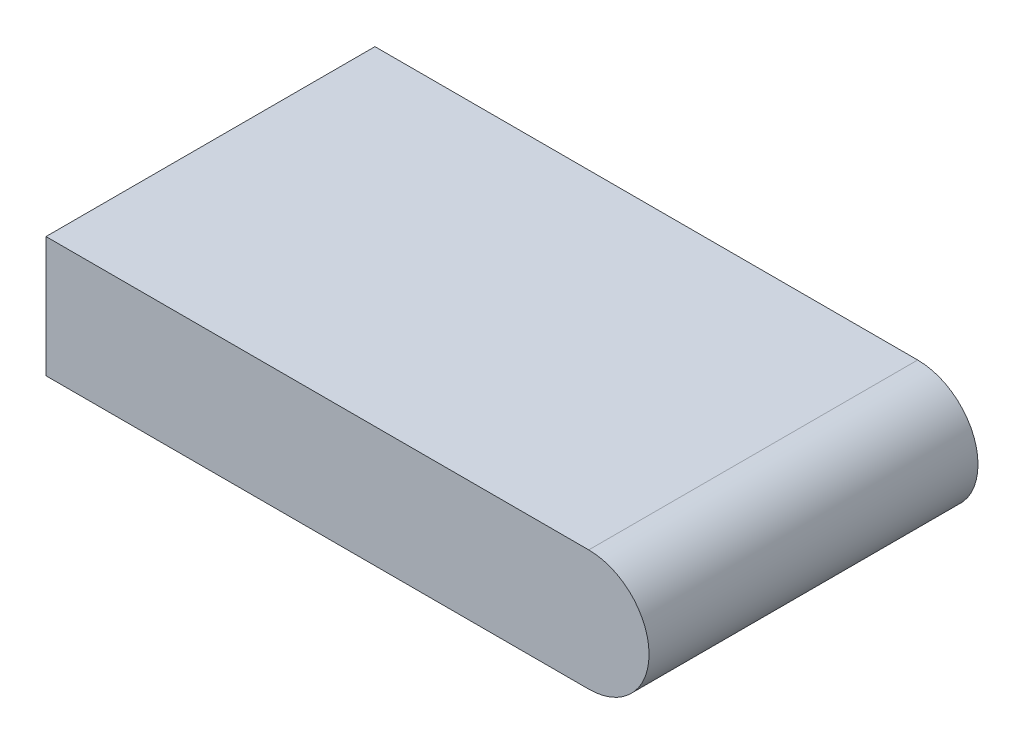
ISO-10303-21;
HEADER;
FILE_DESCRIPTION(('STEP AP214'),'2;1');
FILE_NAME('part.step','',(''),(''),'','','');
FILE_SCHEMA(('AUTOMOTIVE_DESIGN { 1 0 10303 214 1 1 1 1 }'));
ENDSEC;
DATA;
#1=APPLICATION_CONTEXT('core data for automotive mechanical design processes');
#2=APPLICATION_PROTOCOL_DEFINITION('international standard','automotive_design',2000,#1);
#3=PRODUCT_CONTEXT('',#1,'mechanical');
#4=PRODUCT('Part','Part','',(#3));
#5=PRODUCT_RELATED_PRODUCT_CATEGORY('part','',(#4));
#6=PRODUCT_DEFINITION_FORMATION('','',#4);
#7=PRODUCT_DEFINITION_CONTEXT('part definition',#1,'design');
#8=PRODUCT_DEFINITION('design','',#6,#7);
#9=PRODUCT_DEFINITION_SHAPE('','',#8);
#10=(LENGTH_UNIT() NAMED_UNIT(*) SI_UNIT(.MILLI.,.METRE.));
#11=(NAMED_UNIT(*) PLANE_ANGLE_UNIT() SI_UNIT($,.RADIAN.));
#12=(NAMED_UNIT(*) SI_UNIT($,.STERADIAN.) SOLID_ANGLE_UNIT());
#13=UNCERTAINTY_MEASURE_WITH_UNIT(LENGTH_MEASURE(1.E-05),#10,'distance_accuracy_value','');
#14=(GEOMETRIC_REPRESENTATION_CONTEXT(3) GLOBAL_UNCERTAINTY_ASSIGNED_CONTEXT((#13)) GLOBAL_UNIT_ASSIGNED_CONTEXT((#10,
#11,#12)) REPRESENTATION_CONTEXT('',''));
#15=CARTESIAN_POINT('',(0.,0.,0.));
#16=DIRECTION('',(0.,0.,1.));
#17=DIRECTION('',(1.,0.,0.));
#18=AXIS2_PLACEMENT_3D('',#15,#16,#17);
#19=CARTESIAN_POINT('',(0.,11.,0.));
#20=DIRECTION('',(1.,0.,0.));
#21=DIRECTION('',(0.,0.,-1.));
#22=AXIS2_PLACEMENT_3D('',#19,#20,#21);
#23=PLANE('',#22);
#24=DIRECTION('',(0.,0.,1.));
#25=VECTOR('',#24,1.);
#26=CARTESIAN_POINT('',(0.,0.,0.));
#27=LINE('',#26,#25);
#28=CARTESIAN_POINT('',(0.,0.,-30.));
#29=VERTEX_POINT('',#28);
#30=CARTESIAN_POINT('',(0.,0.,0.));
#31=VERTEX_POINT('',#30);
#32=EDGE_CURVE('E90',#29,#31,#27,.T.);
#33=ORIENTED_EDGE('',*,*,#32,.T.);
#34=DIRECTION('',(0.,-1.,0.));
#35=VECTOR('',#34,1.);
#36=CARTESIAN_POINT('',(0.,11.,0.));
#37=LINE('',#36,#35);
#38=CARTESIAN_POINT('',(0.,11.,0.));
#39=VERTEX_POINT('',#38);
#40=EDGE_CURVE('E11',#39,#31,#37,.T.);
#41=ORIENTED_EDGE('',*,*,#40,.F.);
#42=DIRECTION('',(0.,0.,1.));
#43=VECTOR('',#42,1.);
#44=CARTESIAN_POINT('',(0.,11.,0.));
#45=LINE('',#44,#43);
#46=CARTESIAN_POINT('',(0.,11.,-30.));
#47=VERTEX_POINT('',#46);
#48=EDGE_CURVE('E92',#47,#39,#45,.T.);
#49=ORIENTED_EDGE('',*,*,#48,.F.);
#50=DIRECTION('',(0.,-1.,0.));
#51=VECTOR('',#50,1.);
#52=CARTESIAN_POINT('',(0.,11.,-30.));
#53=LINE('',#52,#51);
#54=EDGE_CURVE('E48',#47,#29,#53,.T.);
#55=ORIENTED_EDGE('',*,*,#54,.T.);
#56=EDGE_LOOP('',(#33,#41,#49,#55));
#57=FACE_BOUND('',#56,.T.);
#58=ADVANCED_FACE('F39',(#57),#23,.F.);
#59=CARTESIAN_POINT('',(0.,11.,0.));
#60=DIRECTION('',(0.,0.,-1.));
#61=DIRECTION('',(-1.,0.,0.));
#62=AXIS2_PLACEMENT_3D('',#59,#60,#61);
#63=PLANE('',#62);
#64=DIRECTION('',(1.,0.,0.));
#65=VECTOR('',#64,1.);
#66=CARTESIAN_POINT('',(0.,0.,0.));
#67=LINE('',#66,#65);
#68=CARTESIAN_POINT('',(49.5,0.,0.));
#69=VERTEX_POINT('',#68);
#70=EDGE_CURVE('E69',#31,#69,#67,.T.);
#71=ORIENTED_EDGE('',*,*,#70,.T.);
#72=CARTESIAN_POINT('',(49.5,5.5,0.));
#73=DIRECTION('',(0.,0.,-1.));
#74=DIRECTION('',(-1.,0.,0.));
#75=AXIS2_PLACEMENT_3D('',#72,#73,#74);
#76=CIRCLE('',#75,5.5);
#77=CARTESIAN_POINT('',(49.5,11.,0.));
#78=VERTEX_POINT('',#77);
#79=EDGE_CURVE('E99',#78,#69,#76,.T.);
#80=ORIENTED_EDGE('',*,*,#79,.F.);
#81=DIRECTION('',(1.,0.,0.));
#82=VECTOR('',#81,1.);
#83=CARTESIAN_POINT('',(0.,11.,0.));
#84=LINE('',#83,#82);
#85=EDGE_CURVE('E81',#39,#78,#84,.T.);
#86=ORIENTED_EDGE('',*,*,#85,.F.);
#87=ORIENTED_EDGE('',*,*,#40,.T.);
#88=EDGE_LOOP('',(#71,#80,#86,#87));
#89=FACE_BOUND('',#88,.T.);
#90=ADVANCED_FACE('F125',(#89),#63,.F.);
#91=CARTESIAN_POINT('',(0.,11.,-30.));
#92=DIRECTION('',(0.,0.,1.));
#93=DIRECTION('',(1.,0.,0.));
#94=AXIS2_PLACEMENT_3D('',#91,#92,#93);
#95=PLANE('',#94);
#96=DIRECTION('',(-1.,0.,0.));
#97=VECTOR('',#96,1.);
#98=CARTESIAN_POINT('',(0.,11.,-30.));
#99=LINE('',#98,#97);
#100=CARTESIAN_POINT('',(49.5,11.,-30.));
#101=VERTEX_POINT('',#100);
#102=EDGE_CURVE('E56',#101,#47,#99,.T.);
#103=ORIENTED_EDGE('',*,*,#102,.F.);
#104=CARTESIAN_POINT('',(49.5,5.5,-30.));
#105=DIRECTION('',(0.,0.,-1.));
#106=DIRECTION('',(-1.,0.,0.));
#107=AXIS2_PLACEMENT_3D('',#104,#105,#106);
#108=CIRCLE('',#107,5.5);
#109=CARTESIAN_POINT('',(49.5,0.,-30.));
#110=VERTEX_POINT('',#109);
#111=EDGE_CURVE('E98',#101,#110,#108,.T.);
#112=ORIENTED_EDGE('',*,*,#111,.T.);
#113=DIRECTION('',(-1.,0.,0.));
#114=VECTOR('',#113,1.);
#115=CARTESIAN_POINT('',(0.,0.,-30.));
#116=LINE('',#115,#114);
#117=EDGE_CURVE('E76',#110,#29,#116,.T.);
#118=ORIENTED_EDGE('',*,*,#117,.T.);
#119=ORIENTED_EDGE('',*,*,#54,.F.);
#120=EDGE_LOOP('',(#103,#112,#118,#119));
#121=FACE_BOUND('',#120,.T.);
#122=ADVANCED_FACE('F102',(#121),#95,.F.);
#123=CARTESIAN_POINT('',(0.,11.,0.));
#124=DIRECTION('',(0.,-1.,0.));
#125=DIRECTION('',(0.,0.,-1.));
#126=AXIS2_PLACEMENT_3D('',#123,#124,#125);
#127=PLANE('',#126);
#128=ORIENTED_EDGE('',*,*,#48,.T.);
#129=ORIENTED_EDGE('',*,*,#85,.T.);
#130=DIRECTION('',(0.,0.,-1.));
#131=VECTOR('',#130,1.);
#132=CARTESIAN_POINT('',(49.5,11.,0.));
#133=LINE('',#132,#131);
#134=EDGE_CURVE('E112',#78,#101,#133,.T.);
#135=ORIENTED_EDGE('',*,*,#134,.T.);
#136=ORIENTED_EDGE('',*,*,#102,.T.);
#137=EDGE_LOOP('',(#128,#129,#135,#136));
#138=FACE_BOUND('',#137,.T.);
#139=ADVANCED_FACE('F124',(#138),#127,.F.);
#140=CARTESIAN_POINT('',(0.,0.,0.));
#141=DIRECTION('',(0.,-1.,0.));
#142=DIRECTION('',(0.,0.,-1.));
#143=AXIS2_PLACEMENT_3D('',#140,#141,#142);
#144=PLANE('',#143);
#145=ORIENTED_EDGE('',*,*,#32,.F.);
#146=ORIENTED_EDGE('',*,*,#117,.F.);
#147=DIRECTION('',(0.,0.,-1.));
#148=VECTOR('',#147,1.);
#149=CARTESIAN_POINT('',(49.5,0.,0.));
#150=LINE('',#149,#148);
#151=EDGE_CURVE('E87',#69,#110,#150,.T.);
#152=ORIENTED_EDGE('',*,*,#151,.F.);
#153=ORIENTED_EDGE('',*,*,#70,.F.);
#154=EDGE_LOOP('',(#145,#146,#152,#153));
#155=FACE_BOUND('',#154,.T.);
#156=ADVANCED_FACE('F86',(#155),#144,.T.);
#157=CARTESIAN_POINT('',(49.5,5.5,0.));
#158=DIRECTION('',(0.,0.,-1.));
#159=DIRECTION('',(-1.,0.,0.));
#160=AXIS2_PLACEMENT_3D('',#157,#158,#159);
#161=CYLINDRICAL_SURFACE('',#160,5.5);
#162=ORIENTED_EDGE('',*,*,#134,.F.);
#163=ORIENTED_EDGE('',*,*,#79,.T.);
#164=ORIENTED_EDGE('',*,*,#151,.T.);
#165=ORIENTED_EDGE('',*,*,#111,.F.);
#166=EDGE_LOOP('',(#162,#163,#164,#165));
#167=FACE_BOUND('',#166,.T.);
#168=ADVANCED_FACE('F97',(#167),#161,.T.);
#169=CLOSED_SHELL('',(#58,#90,#122,#139,#156,#168));
#170=MANIFOLD_SOLID_BREP('B2',#169);
#171=ADVANCED_BREP_SHAPE_REPRESENTATION('',(#18,#170),#14);
#172=SHAPE_DEFINITION_REPRESENTATION(#9,#171);
ENDSEC;
END-ISO-10303-21;
